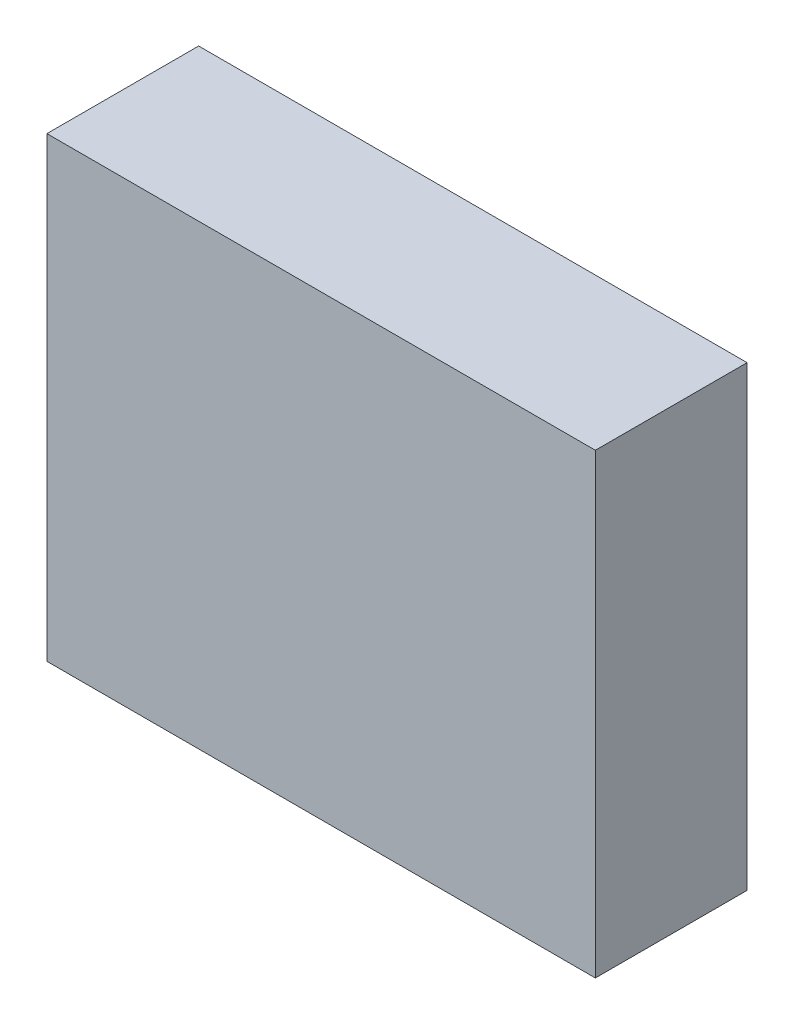
ISO-10303-21;
HEADER;
FILE_DESCRIPTION(('STEP AP214'),'2;1');
FILE_NAME('part.step','',(''),(''),'','','');
FILE_SCHEMA(('AUTOMOTIVE_DESIGN { 1 0 10303 214 1 1 1 1 }'));
ENDSEC;
DATA;
#1=APPLICATION_CONTEXT('core data for automotive mechanical design processes');
#2=APPLICATION_PROTOCOL_DEFINITION('international standard','automotive_design',2000,#1);
#3=PRODUCT_CONTEXT('',#1,'mechanical');
#4=PRODUCT('Part','Part','',(#3));
#5=PRODUCT_RELATED_PRODUCT_CATEGORY('part','',(#4));
#6=PRODUCT_DEFINITION_FORMATION('','',#4);
#7=PRODUCT_DEFINITION_CONTEXT('part definition',#1,'design');
#8=PRODUCT_DEFINITION('design','',#6,#7);
#9=PRODUCT_DEFINITION_SHAPE('','',#8);
#10=(LENGTH_UNIT() NAMED_UNIT(*) SI_UNIT(.MILLI.,.METRE.));
#11=(NAMED_UNIT(*) PLANE_ANGLE_UNIT() SI_UNIT($,.RADIAN.));
#12=(NAMED_UNIT(*) SI_UNIT($,.STERADIAN.) SOLID_ANGLE_UNIT());
#13=UNCERTAINTY_MEASURE_WITH_UNIT(LENGTH_MEASURE(1.E-05),#10,'distance_accuracy_value','');
#14=(GEOMETRIC_REPRESENTATION_CONTEXT(3) GLOBAL_UNCERTAINTY_ASSIGNED_CONTEXT((#13)) GLOBAL_UNIT_ASSIGNED_CONTEXT((#10,
#11,#12)) REPRESENTATION_CONTEXT('',''));
#15=CARTESIAN_POINT('',(0.,0.,0.));
#16=DIRECTION('',(0.,0.,1.));
#17=DIRECTION('',(1.,0.,0.));
#18=AXIS2_PLACEMENT_3D('',#15,#16,#17);
#19=CARTESIAN_POINT('',(-1.49999954,1.25000004,0.));
#20=DIRECTION('',(0.,1.,0.));
#21=DIRECTION('',(1.,0.,0.));
#22=AXIS2_PLACEMENT_3D('',#19,#20,#21);
#23=PLANE('',#22);
#24=DIRECTION('',(0.,0.,1.));
#25=VECTOR('',#24,1.);
#26=CARTESIAN_POINT('',(-1.49999954,1.25000004,0.));
#27=LINE('',#26,#25);
#28=CARTESIAN_POINT('',(-1.49999954,1.25000004,0.));
#29=VERTEX_POINT('',#28);
#30=CARTESIAN_POINT('',(-1.49999954,1.25000004,0.83000088));
#31=VERTEX_POINT('',#30);
#32=EDGE_CURVE('E11',#29,#31,#27,.T.);
#33=ORIENTED_EDGE('',*,*,#32,.T.);
#34=DIRECTION('',(1.,0.,0.));
#35=VECTOR('',#34,1.);
#36=CARTESIAN_POINT('',(-1.49999954,1.25000004,0.83000088));
#37=LINE('',#36,#35);
#38=CARTESIAN_POINT('',(1.49999954,1.25000004,0.83000088));
#39=VERTEX_POINT('',#38);
#40=EDGE_CURVE('E24',#31,#39,#37,.T.);
#41=ORIENTED_EDGE('',*,*,#40,.T.);
#42=DIRECTION('',(0.,0.,1.));
#43=VECTOR('',#42,1.);
#44=CARTESIAN_POINT('',(1.49999954,1.25000004,0.));
#45=LINE('',#44,#43);
#46=CARTESIAN_POINT('',(1.49999954,1.25000004,0.));
#47=VERTEX_POINT('',#46);
#48=EDGE_CURVE('E85',#47,#39,#45,.T.);
#49=ORIENTED_EDGE('',*,*,#48,.F.);
#50=DIRECTION('',(1.,0.,0.));
#51=VECTOR('',#50,1.);
#52=CARTESIAN_POINT('',(-1.49999954,1.25000004,0.));
#53=LINE('',#52,#51);
#54=EDGE_CURVE('E83',#29,#47,#53,.T.);
#55=ORIENTED_EDGE('',*,*,#54,.F.);
#56=EDGE_LOOP('',(#33,#41,#49,#55));
#57=FACE_BOUND('',#56,.T.);
#58=ADVANCED_FACE('F17',(#57),#23,.T.);
#59=CARTESIAN_POINT('',(1.49999954,1.25000004,0.));
#60=DIRECTION('',(1.,0.,0.));
#61=DIRECTION('',(0.,-1.,0.));
#62=AXIS2_PLACEMENT_3D('',#59,#60,#61);
#63=PLANE('',#62);
#64=ORIENTED_EDGE('',*,*,#48,.T.);
#65=DIRECTION('',(0.,-1.,0.));
#66=VECTOR('',#65,1.);
#67=CARTESIAN_POINT('',(1.49999954,1.25000004,0.83000088));
#68=LINE('',#67,#66);
#69=CARTESIAN_POINT('',(1.49999954,-1.25000004,0.83000088));
#70=VERTEX_POINT('',#69);
#71=EDGE_CURVE('E81',#39,#70,#68,.T.);
#72=ORIENTED_EDGE('',*,*,#71,.T.);
#73=DIRECTION('',(0.,0.,1.));
#74=VECTOR('',#73,1.);
#75=CARTESIAN_POINT('',(1.49999954,-1.25000004,0.));
#76=LINE('',#75,#74);
#77=CARTESIAN_POINT('',(1.49999954,-1.25000004,0.));
#78=VERTEX_POINT('',#77);
#79=EDGE_CURVE('E79',#78,#70,#76,.T.);
#80=ORIENTED_EDGE('',*,*,#79,.F.);
#81=DIRECTION('',(0.,-1.,0.));
#82=VECTOR('',#81,1.);
#83=CARTESIAN_POINT('',(1.49999954,1.25000004,0.));
#84=LINE('',#83,#82);
#85=EDGE_CURVE('E70',#47,#78,#84,.T.);
#86=ORIENTED_EDGE('',*,*,#85,.F.);
#87=EDGE_LOOP('',(#64,#72,#80,#86));
#88=FACE_BOUND('',#87,.T.);
#89=ADVANCED_FACE('F90',(#88),#63,.T.);
#90=CARTESIAN_POINT('',(1.49999954,-1.25000004,0.));
#91=DIRECTION('',(0.,-1.,0.));
#92=DIRECTION('',(-1.,0.,0.));
#93=AXIS2_PLACEMENT_3D('',#90,#91,#92);
#94=PLANE('',#93);
#95=ORIENTED_EDGE('',*,*,#79,.T.);
#96=DIRECTION('',(-1.,0.,0.));
#97=VECTOR('',#96,1.);
#98=CARTESIAN_POINT('',(1.49999954,-1.25000004,0.83000088));
#99=LINE('',#98,#97);
#100=CARTESIAN_POINT('',(-1.49999954,-1.25000004,0.83000088));
#101=VERTEX_POINT('',#100);
#102=EDGE_CURVE('E60',#70,#101,#99,.T.);
#103=ORIENTED_EDGE('',*,*,#102,.T.);
#104=DIRECTION('',(0.,0.,1.));
#105=VECTOR('',#104,1.);
#106=CARTESIAN_POINT('',(-1.49999954,-1.25000004,0.));
#107=LINE('',#106,#105);
#108=CARTESIAN_POINT('',(-1.49999954,-1.25000004,0.));
#109=VERTEX_POINT('',#108);
#110=EDGE_CURVE('E54',#109,#101,#107,.T.);
#111=ORIENTED_EDGE('',*,*,#110,.F.);
#112=DIRECTION('',(-1.,0.,0.));
#113=VECTOR('',#112,1.);
#114=CARTESIAN_POINT('',(1.49999954,-1.25000004,0.));
#115=LINE('',#114,#113);
#116=EDGE_CURVE('E58',#78,#109,#115,.T.);
#117=ORIENTED_EDGE('',*,*,#116,.F.);
#118=EDGE_LOOP('',(#95,#103,#111,#117));
#119=FACE_BOUND('',#118,.T.);
#120=ADVANCED_FACE('F57',(#119),#94,.T.);
#121=CARTESIAN_POINT('',(-1.49999954,-1.25000004,0.));
#122=DIRECTION('',(-1.,0.,0.));
#123=DIRECTION('',(0.,1.,0.));
#124=AXIS2_PLACEMENT_3D('',#121,#122,#123);
#125=PLANE('',#124);
#126=ORIENTED_EDGE('',*,*,#110,.T.);
#127=DIRECTION('',(0.,1.,0.));
#128=VECTOR('',#127,1.);
#129=CARTESIAN_POINT('',(-1.49999954,-1.25000004,0.83000088));
#130=LINE('',#129,#128);
#131=EDGE_CURVE('E71',#101,#31,#130,.T.);
#132=ORIENTED_EDGE('',*,*,#131,.T.);
#133=ORIENTED_EDGE('',*,*,#32,.F.);
#134=DIRECTION('',(0.,1.,0.));
#135=VECTOR('',#134,1.);
#136=CARTESIAN_POINT('',(-1.49999954,-1.25000004,0.));
#137=LINE('',#136,#135);
#138=EDGE_CURVE('E68',#109,#29,#137,.T.);
#139=ORIENTED_EDGE('',*,*,#138,.F.);
#140=EDGE_LOOP('',(#126,#132,#133,#139));
#141=FACE_BOUND('',#140,.T.);
#142=ADVANCED_FACE('F73',(#141),#125,.T.);
#143=CARTESIAN_POINT('',(-1.49999954,1.25000004,0.));
#144=DIRECTION('',(0.,0.,1.));
#145=DIRECTION('',(1.,0.,0.));
#146=AXIS2_PLACEMENT_3D('',#143,#144,#145);
#147=PLANE('',#146);
#148=ORIENTED_EDGE('',*,*,#54,.T.);
#149=ORIENTED_EDGE('',*,*,#85,.T.);
#150=ORIENTED_EDGE('',*,*,#116,.T.);
#151=ORIENTED_EDGE('',*,*,#138,.T.);
#152=EDGE_LOOP('',(#148,#149,#150,#151));
#153=FACE_BOUND('',#152,.T.);
#154=ADVANCED_FACE('F67',(#153),#147,.F.);
#155=CARTESIAN_POINT('',(-1.49999954,1.25000004,0.83000088));
#156=DIRECTION('',(0.,0.,1.));
#157=DIRECTION('',(1.,0.,0.));
#158=AXIS2_PLACEMENT_3D('',#155,#156,#157);
#159=PLANE('',#158);
#160=ORIENTED_EDGE('',*,*,#131,.F.);
#161=ORIENTED_EDGE('',*,*,#102,.F.);
#162=ORIENTED_EDGE('',*,*,#71,.F.);
#163=ORIENTED_EDGE('',*,*,#40,.F.);
#164=EDGE_LOOP('',(#160,#161,#162,#163));
#165=FACE_BOUND('',#164,.T.);
#166=ADVANCED_FACE('F91',(#165),#159,.T.);
#167=CLOSED_SHELL('',(#58,#89,#120,#142,#154,#166));
#168=MANIFOLD_SOLID_BREP('B1',#167);
#169=ADVANCED_BREP_SHAPE_REPRESENTATION('',(#18,#168),#14);
#170=SHAPE_DEFINITION_REPRESENTATION(#9,#169);
ENDSEC;
END-ISO-10303-21;
